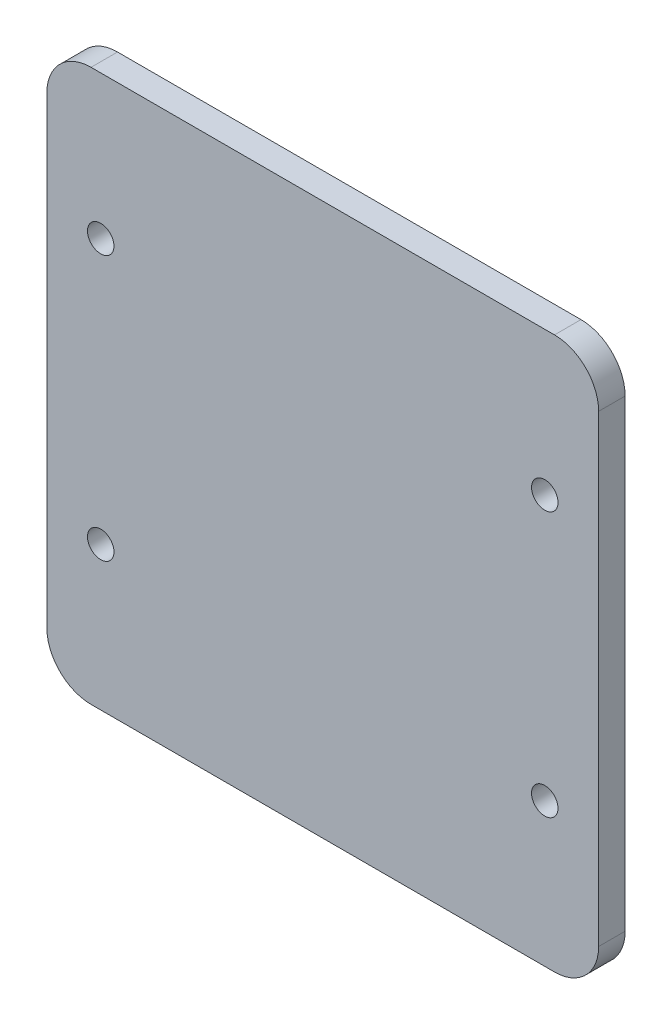
ISO-10303-21;
HEADER;
FILE_DESCRIPTION(('STEP AP214'),'2;1');
FILE_NAME('part.step','',(''),(''),'','','');
FILE_SCHEMA(('AUTOMOTIVE_DESIGN { 1 0 10303 214 1 1 1 1 }'));
ENDSEC;
DATA;
#1=APPLICATION_CONTEXT('core data for automotive mechanical design processes');
#2=APPLICATION_PROTOCOL_DEFINITION('international standard','automotive_design',2000,#1);
#3=PRODUCT_CONTEXT('',#1,'mechanical');
#4=PRODUCT('Part','Part','',(#3));
#5=PRODUCT_RELATED_PRODUCT_CATEGORY('part','',(#4));
#6=PRODUCT_DEFINITION_FORMATION('','',#4);
#7=PRODUCT_DEFINITION_CONTEXT('part definition',#1,'design');
#8=PRODUCT_DEFINITION('design','',#6,#7);
#9=PRODUCT_DEFINITION_SHAPE('','',#8);
#10=(LENGTH_UNIT() NAMED_UNIT(*) SI_UNIT(.MILLI.,.METRE.));
#11=(NAMED_UNIT(*) PLANE_ANGLE_UNIT() SI_UNIT($,.RADIAN.));
#12=(NAMED_UNIT(*) SI_UNIT($,.STERADIAN.) SOLID_ANGLE_UNIT());
#13=UNCERTAINTY_MEASURE_WITH_UNIT(LENGTH_MEASURE(1.E-05),#10,'distance_accuracy_value','');
#14=(GEOMETRIC_REPRESENTATION_CONTEXT(3) GLOBAL_UNCERTAINTY_ASSIGNED_CONTEXT((#13)) GLOBAL_UNIT_ASSIGNED_CONTEXT((#10,
#11,#12)) REPRESENTATION_CONTEXT('',''));
#15=CARTESIAN_POINT('',(0.,0.,0.));
#16=DIRECTION('',(0.,0.,1.));
#17=DIRECTION('',(1.,0.,0.));
#18=AXIS2_PLACEMENT_3D('',#15,#16,#17);
#19=CARTESIAN_POINT('',(-62.5,-62.5,6.));
#20=DIRECTION('',(1.,0.,0.));
#21=DIRECTION('',(0.,0.,-1.));
#22=AXIS2_PLACEMENT_3D('',#19,#20,#21);
#23=PLANE('',#22);
#24=DIRECTION('',(0.,-1.,0.));
#25=VECTOR('',#24,1.);
#26=CARTESIAN_POINT('',(-62.5,-62.5,6.));
#27=LINE('',#26,#25);
#28=CARTESIAN_POINT('',(-62.5,52.5,6.));
#29=VERTEX_POINT('',#28);
#30=CARTESIAN_POINT('',(-62.5,-52.5,6.));
#31=VERTEX_POINT('',#30);
#32=EDGE_CURVE('E128',#29,#31,#27,.T.);
#33=ORIENTED_EDGE('',*,*,#32,.F.);
#34=DIRECTION('',(0.,0.,-1.));
#35=VECTOR('',#34,1.);
#36=CARTESIAN_POINT('',(-62.5,52.5,6.));
#37=LINE('',#36,#35);
#38=CARTESIAN_POINT('',(-62.5,52.5,0.));
#39=VERTEX_POINT('',#38);
#40=EDGE_CURVE('E112',#29,#39,#37,.T.);
#41=ORIENTED_EDGE('',*,*,#40,.T.);
#42=DIRECTION('',(0.,-1.,0.));
#43=VECTOR('',#42,1.);
#44=CARTESIAN_POINT('',(-62.5,-62.5,0.));
#45=LINE('',#44,#43);
#46=CARTESIAN_POINT('',(-62.5,-52.5,0.));
#47=VERTEX_POINT('',#46);
#48=EDGE_CURVE('E125',#39,#47,#45,.T.);
#49=ORIENTED_EDGE('',*,*,#48,.T.);
#50=DIRECTION('',(0.,0.,-1.));
#51=VECTOR('',#50,1.);
#52=CARTESIAN_POINT('',(-62.5,-52.5,6.));
#53=LINE('',#52,#51);
#54=EDGE_CURVE('E131',#47,#31,#53,.F.);
#55=ORIENTED_EDGE('',*,*,#54,.T.);
#56=EDGE_LOOP('',(#33,#41,#49,#55));
#57=FACE_BOUND('',#56,.T.);
#58=ADVANCED_FACE('F39',(#57),#23,.F.);
#59=CARTESIAN_POINT('',(62.5,-62.5,6.));
#60=DIRECTION('',(0.,1.,0.));
#61=DIRECTION('',(-1.,0.,0.));
#62=AXIS2_PLACEMENT_3D('',#59,#60,#61);
#63=PLANE('',#62);
#64=DIRECTION('',(1.,0.,0.));
#65=VECTOR('',#64,1.);
#66=CARTESIAN_POINT('',(62.5,-62.5,0.));
#67=LINE('',#66,#65);
#68=CARTESIAN_POINT('',(-52.5,-62.5,0.));
#69=VERTEX_POINT('',#68);
#70=CARTESIAN_POINT('',(52.5,-62.5,0.));
#71=VERTEX_POINT('',#70);
#72=EDGE_CURVE('E136',#69,#71,#67,.T.);
#73=ORIENTED_EDGE('',*,*,#72,.T.);
#74=DIRECTION('',(0.,0.,-1.));
#75=VECTOR('',#74,1.);
#76=CARTESIAN_POINT('',(52.5,-62.5,6.));
#77=LINE('',#76,#75);
#78=CARTESIAN_POINT('',(52.5,-62.5,6.));
#79=VERTEX_POINT('',#78);
#80=EDGE_CURVE('E11',#71,#79,#77,.F.);
#81=ORIENTED_EDGE('',*,*,#80,.T.);
#82=DIRECTION('',(1.,0.,0.));
#83=VECTOR('',#82,1.);
#84=CARTESIAN_POINT('',(62.5,-62.5,6.));
#85=LINE('',#84,#83);
#86=CARTESIAN_POINT('',(-52.5,-62.5,6.));
#87=VERTEX_POINT('',#86);
#88=EDGE_CURVE('E254',#87,#79,#85,.T.);
#89=ORIENTED_EDGE('',*,*,#88,.F.);
#90=DIRECTION('',(0.,0.,-1.));
#91=VECTOR('',#90,1.);
#92=CARTESIAN_POINT('',(-52.5,-62.5,6.));
#93=LINE('',#92,#91);
#94=EDGE_CURVE('E49',#87,#69,#93,.T.);
#95=ORIENTED_EDGE('',*,*,#94,.T.);
#96=EDGE_LOOP('',(#73,#81,#89,#95));
#97=FACE_BOUND('',#96,.T.);
#98=ADVANCED_FACE('F220',(#97),#63,.F.);
#99=CARTESIAN_POINT('',(62.5,-62.5,6.));
#100=DIRECTION('',(-1.,0.,0.));
#101=DIRECTION('',(0.,0.,1.));
#102=AXIS2_PLACEMENT_3D('',#99,#100,#101);
#103=PLANE('',#102);
#104=DIRECTION('',(0.,1.,0.));
#105=VECTOR('',#104,1.);
#106=CARTESIAN_POINT('',(62.5,-62.5,0.));
#107=LINE('',#106,#105);
#108=CARTESIAN_POINT('',(62.5,-52.5,0.));
#109=VERTEX_POINT('',#108);
#110=CARTESIAN_POINT('',(62.5,52.5,0.));
#111=VERTEX_POINT('',#110);
#112=EDGE_CURVE('E141',#109,#111,#107,.T.);
#113=ORIENTED_EDGE('',*,*,#112,.T.);
#114=DIRECTION('',(0.,0.,-1.));
#115=VECTOR('',#114,1.);
#116=CARTESIAN_POINT('',(62.5,52.5,6.));
#117=LINE('',#116,#115);
#118=CARTESIAN_POINT('',(62.5,52.5,6.));
#119=VERTEX_POINT('',#118);
#120=EDGE_CURVE('E57',#111,#119,#117,.F.);
#121=ORIENTED_EDGE('',*,*,#120,.T.);
#122=DIRECTION('',(0.,1.,0.));
#123=VECTOR('',#122,1.);
#124=CARTESIAN_POINT('',(62.5,-62.5,6.));
#125=LINE('',#124,#123);
#126=CARTESIAN_POINT('',(62.5,-52.5,6.));
#127=VERTEX_POINT('',#126);
#128=EDGE_CURVE('E245',#127,#119,#125,.T.);
#129=ORIENTED_EDGE('',*,*,#128,.F.);
#130=DIRECTION('',(0.,0.,-1.));
#131=VECTOR('',#130,1.);
#132=CARTESIAN_POINT('',(62.5,-52.5,6.));
#133=LINE('',#132,#131);
#134=EDGE_CURVE('E179',#127,#109,#133,.T.);
#135=ORIENTED_EDGE('',*,*,#134,.T.);
#136=EDGE_LOOP('',(#113,#121,#129,#135));
#137=FACE_BOUND('',#136,.T.);
#138=ADVANCED_FACE('F225',(#137),#103,.F.);
#139=CARTESIAN_POINT('',(62.5,62.5,6.));
#140=DIRECTION('',(0.,-1.,0.));
#141=DIRECTION('',(1.,0.,0.));
#142=AXIS2_PLACEMENT_3D('',#139,#140,#141);
#143=PLANE('',#142);
#144=DIRECTION('',(-1.,0.,0.));
#145=VECTOR('',#144,1.);
#146=CARTESIAN_POINT('',(62.5,62.5,0.));
#147=LINE('',#146,#145);
#148=CARTESIAN_POINT('',(52.5,62.5,0.));
#149=VERTEX_POINT('',#148);
#150=CARTESIAN_POINT('',(-52.5,62.5,0.));
#151=VERTEX_POINT('',#150);
#152=EDGE_CURVE('E151',#149,#151,#147,.T.);
#153=ORIENTED_EDGE('',*,*,#152,.T.);
#154=DIRECTION('',(0.,0.,-1.));
#155=VECTOR('',#154,1.);
#156=CARTESIAN_POINT('',(-52.5,62.5,6.));
#157=LINE('',#156,#155);
#158=CARTESIAN_POINT('',(-52.5,62.5,6.));
#159=VERTEX_POINT('',#158);
#160=EDGE_CURVE('E113',#151,#159,#157,.F.);
#161=ORIENTED_EDGE('',*,*,#160,.T.);
#162=DIRECTION('',(-1.,0.,0.));
#163=VECTOR('',#162,1.);
#164=CARTESIAN_POINT('',(62.5,62.5,6.));
#165=LINE('',#164,#163);
#166=CARTESIAN_POINT('',(52.5,62.5,6.));
#167=VERTEX_POINT('',#166);
#168=EDGE_CURVE('E146',#167,#159,#165,.T.);
#169=ORIENTED_EDGE('',*,*,#168,.F.);
#170=DIRECTION('',(0.,0.,-1.));
#171=VECTOR('',#170,1.);
#172=CARTESIAN_POINT('',(52.5,62.5,6.));
#173=LINE('',#172,#171);
#174=EDGE_CURVE('E119',#167,#149,#173,.T.);
#175=ORIENTED_EDGE('',*,*,#174,.T.);
#176=EDGE_LOOP('',(#153,#161,#169,#175));
#177=FACE_BOUND('',#176,.T.);
#178=ADVANCED_FACE('F250',(#177),#143,.F.);
#179=CARTESIAN_POINT('',(0.,0.,6.));
#180=DIRECTION('',(0.,0.,1.));
#181=DIRECTION('',(1.,0.,0.));
#182=AXIS2_PLACEMENT_3D('',#179,#180,#181);
#183=PLANE('',#182);
#184=CARTESIAN_POINT('',(50.3,-30.,6.));
#185=DIRECTION('',(0.,0.,1.));
#186=DIRECTION('',(1.,0.,0.));
#187=AXIS2_PLACEMENT_3D('',#184,#185,#186);
#188=CIRCLE('',#187,3.);
#189=CARTESIAN_POINT('',(53.3,-30.,6.));
#190=VERTEX_POINT('',#189);
#191=EDGE_CURVE('E263',#190,#190,#188,.T.);
#192=ORIENTED_EDGE('',*,*,#191,.F.);
#193=EDGE_LOOP('',(#192));
#194=FACE_BOUND('',#193,.T.);
#195=CARTESIAN_POINT('',(-50.3,30.,6.));
#196=DIRECTION('',(0.,0.,1.));
#197=DIRECTION('',(1.,0.,0.));
#198=AXIS2_PLACEMENT_3D('',#195,#196,#197);
#199=CIRCLE('',#198,3.);
#200=CARTESIAN_POINT('',(-47.3,30.,6.));
#201=VERTEX_POINT('',#200);
#202=EDGE_CURVE('E264',#201,#201,#199,.T.);
#203=ORIENTED_EDGE('',*,*,#202,.F.);
#204=EDGE_LOOP('',(#203));
#205=FACE_BOUND('',#204,.T.);
#206=CARTESIAN_POINT('',(-50.3,-30.,6.));
#207=DIRECTION('',(0.,0.,1.));
#208=DIRECTION('',(1.,0.,0.));
#209=AXIS2_PLACEMENT_3D('',#206,#207,#208);
#210=CIRCLE('',#209,3.);
#211=CARTESIAN_POINT('',(-47.3,-30.,6.));
#212=VERTEX_POINT('',#211);
#213=EDGE_CURVE('E267',#212,#212,#210,.T.);
#214=ORIENTED_EDGE('',*,*,#213,.F.);
#215=EDGE_LOOP('',(#214));
#216=FACE_BOUND('',#215,.T.);
#217=CARTESIAN_POINT('',(50.3,30.,6.));
#218=DIRECTION('',(0.,0.,1.));
#219=DIRECTION('',(1.,0.,0.));
#220=AXIS2_PLACEMENT_3D('',#217,#218,#219);
#221=CIRCLE('',#220,3.);
#222=CARTESIAN_POINT('',(53.3,30.,6.));
#223=VERTEX_POINT('',#222);
#224=EDGE_CURVE('E193',#223,#223,#221,.T.);
#225=ORIENTED_EDGE('',*,*,#224,.F.);
#226=EDGE_LOOP('',(#225));
#227=FACE_BOUND('',#226,.T.);
#228=ORIENTED_EDGE('',*,*,#168,.T.);
#229=CARTESIAN_POINT('',(-52.5,52.5,6.));
#230=DIRECTION('',(0.,0.,1.));
#231=DIRECTION('',(1.,0.,0.));
#232=AXIS2_PLACEMENT_3D('',#229,#230,#231);
#233=CIRCLE('',#232,10.);
#234=EDGE_CURVE('E176',#159,#29,#233,.T.);
#235=ORIENTED_EDGE('',*,*,#234,.T.);
#236=ORIENTED_EDGE('',*,*,#32,.T.);
#237=CARTESIAN_POINT('',(-52.5,-52.5,6.));
#238=DIRECTION('',(0.,0.,1.));
#239=DIRECTION('',(1.,0.,0.));
#240=AXIS2_PLACEMENT_3D('',#237,#238,#239);
#241=CIRCLE('',#240,10.);
#242=EDGE_CURVE('E168',#31,#87,#241,.T.);
#243=ORIENTED_EDGE('',*,*,#242,.T.);
#244=ORIENTED_EDGE('',*,*,#88,.T.);
#245=CARTESIAN_POINT('',(52.5,-52.5,6.));
#246=DIRECTION('',(0.,0.,1.));
#247=DIRECTION('',(1.,0.,0.));
#248=AXIS2_PLACEMENT_3D('',#245,#246,#247);
#249=CIRCLE('',#248,10.);
#250=EDGE_CURVE('E64',#79,#127,#249,.T.);
#251=ORIENTED_EDGE('',*,*,#250,.T.);
#252=ORIENTED_EDGE('',*,*,#128,.T.);
#253=CARTESIAN_POINT('',(52.5,52.5,6.));
#254=DIRECTION('',(0.,0.,1.));
#255=DIRECTION('',(1.,0.,0.));
#256=AXIS2_PLACEMENT_3D('',#253,#254,#255);
#257=CIRCLE('',#256,10.);
#258=EDGE_CURVE('E173',#119,#167,#257,.T.);
#259=ORIENTED_EDGE('',*,*,#258,.T.);
#260=EDGE_LOOP('',(#228,#235,#236,#243,#244,#251,#252,#259));
#261=FACE_BOUND('',#260,.T.);
#262=ADVANCED_FACE('F276',(#194,#205,#216,#227,#261),#183,.T.);
#263=CARTESIAN_POINT('',(0.,0.,0.));
#264=DIRECTION('',(0.,0.,1.));
#265=DIRECTION('',(1.,0.,0.));
#266=AXIS2_PLACEMENT_3D('',#263,#264,#265);
#267=PLANE('',#266);
#268=CARTESIAN_POINT('',(50.3,-30.,0.));
#269=DIRECTION('',(0.,0.,1.));
#270=DIRECTION('',(1.,0.,0.));
#271=AXIS2_PLACEMENT_3D('',#268,#269,#270);
#272=CIRCLE('',#271,3.);
#273=CARTESIAN_POINT('',(53.3,-30.,0.));
#274=VERTEX_POINT('',#273);
#275=EDGE_CURVE('E43',#274,#274,#272,.T.);
#276=ORIENTED_EDGE('',*,*,#275,.T.);
#277=EDGE_LOOP('',(#276));
#278=FACE_BOUND('',#277,.T.);
#279=CARTESIAN_POINT('',(-50.3,30.,0.));
#280=DIRECTION('',(0.,0.,1.));
#281=DIRECTION('',(1.,0.,0.));
#282=AXIS2_PLACEMENT_3D('',#279,#280,#281);
#283=CIRCLE('',#282,3.);
#284=CARTESIAN_POINT('',(-47.3,30.,0.));
#285=VERTEX_POINT('',#284);
#286=EDGE_CURVE('E144',#285,#285,#283,.T.);
#287=ORIENTED_EDGE('',*,*,#286,.T.);
#288=EDGE_LOOP('',(#287));
#289=FACE_BOUND('',#288,.T.);
#290=CARTESIAN_POINT('',(-50.3,-30.,0.));
#291=DIRECTION('',(0.,0.,1.));
#292=DIRECTION('',(1.,0.,0.));
#293=AXIS2_PLACEMENT_3D('',#290,#291,#292);
#294=CIRCLE('',#293,3.);
#295=CARTESIAN_POINT('',(-47.3,-30.,0.));
#296=VERTEX_POINT('',#295);
#297=EDGE_CURVE('E192',#296,#296,#294,.T.);
#298=ORIENTED_EDGE('',*,*,#297,.T.);
#299=EDGE_LOOP('',(#298));
#300=FACE_BOUND('',#299,.T.);
#301=CARTESIAN_POINT('',(50.3,30.,0.));
#302=DIRECTION('',(0.,0.,1.));
#303=DIRECTION('',(1.,0.,0.));
#304=AXIS2_PLACEMENT_3D('',#301,#302,#303);
#305=CIRCLE('',#304,3.);
#306=CARTESIAN_POINT('',(53.3,30.,0.));
#307=VERTEX_POINT('',#306);
#308=EDGE_CURVE('E188',#307,#307,#305,.T.);
#309=ORIENTED_EDGE('',*,*,#308,.T.);
#310=EDGE_LOOP('',(#309));
#311=FACE_BOUND('',#310,.T.);
#312=ORIENTED_EDGE('',*,*,#48,.F.);
#313=CARTESIAN_POINT('',(-52.5,52.5,0.));
#314=DIRECTION('',(0.,0.,1.));
#315=DIRECTION('',(1.,0.,0.));
#316=AXIS2_PLACEMENT_3D('',#313,#314,#315);
#317=CIRCLE('',#316,10.);
#318=EDGE_CURVE('E108',#39,#151,#317,.F.);
#319=ORIENTED_EDGE('',*,*,#318,.T.);
#320=ORIENTED_EDGE('',*,*,#152,.F.);
#321=CARTESIAN_POINT('',(52.5,52.5,0.));
#322=DIRECTION('',(0.,0.,1.));
#323=DIRECTION('',(1.,0.,0.));
#324=AXIS2_PLACEMENT_3D('',#321,#322,#323);
#325=CIRCLE('',#324,10.);
#326=EDGE_CURVE('E120',#149,#111,#325,.F.);
#327=ORIENTED_EDGE('',*,*,#326,.T.);
#328=ORIENTED_EDGE('',*,*,#112,.F.);
#329=CARTESIAN_POINT('',(52.5,-52.5,0.));
#330=DIRECTION('',(0.,0.,1.));
#331=DIRECTION('',(1.,0.,0.));
#332=AXIS2_PLACEMENT_3D('',#329,#330,#331);
#333=CIRCLE('',#332,10.);
#334=EDGE_CURVE('E158',#109,#71,#333,.F.);
#335=ORIENTED_EDGE('',*,*,#334,.T.);
#336=ORIENTED_EDGE('',*,*,#72,.F.);
#337=CARTESIAN_POINT('',(-52.5,-52.5,0.));
#338=DIRECTION('',(0.,0.,1.));
#339=DIRECTION('',(1.,0.,0.));
#340=AXIS2_PLACEMENT_3D('',#337,#338,#339);
#341=CIRCLE('',#340,10.);
#342=EDGE_CURVE('E130',#69,#47,#341,.F.);
#343=ORIENTED_EDGE('',*,*,#342,.T.);
#344=EDGE_LOOP('',(#312,#319,#320,#327,#328,#335,#336,#343));
#345=FACE_BOUND('',#344,.T.);
#346=ADVANCED_FACE('F133',(#278,#289,#300,#311,#345),#267,.F.);
#347=CARTESIAN_POINT('',(-52.5,52.5,6.));
#348=DIRECTION('',(0.,0.,-1.));
#349=DIRECTION('',(-1.,0.,0.));
#350=AXIS2_PLACEMENT_3D('',#347,#348,#349);
#351=CYLINDRICAL_SURFACE('',#350,10.);
#352=ORIENTED_EDGE('',*,*,#234,.F.);
#353=ORIENTED_EDGE('',*,*,#160,.F.);
#354=ORIENTED_EDGE('',*,*,#318,.F.);
#355=ORIENTED_EDGE('',*,*,#40,.F.);
#356=EDGE_LOOP('',(#352,#353,#354,#355));
#357=FACE_BOUND('',#356,.T.);
#358=ADVANCED_FACE('F111',(#357),#351,.T.);
#359=CARTESIAN_POINT('',(52.5,52.5,6.));
#360=DIRECTION('',(0.,0.,-1.));
#361=DIRECTION('',(-1.,0.,0.));
#362=AXIS2_PLACEMENT_3D('',#359,#360,#361);
#363=CYLINDRICAL_SURFACE('',#362,10.);
#364=ORIENTED_EDGE('',*,*,#258,.F.);
#365=ORIENTED_EDGE('',*,*,#120,.F.);
#366=ORIENTED_EDGE('',*,*,#326,.F.);
#367=ORIENTED_EDGE('',*,*,#174,.F.);
#368=EDGE_LOOP('',(#364,#365,#366,#367));
#369=FACE_BOUND('',#368,.T.);
#370=ADVANCED_FACE('F232',(#369),#363,.T.);
#371=CARTESIAN_POINT('',(52.5,-52.5,6.));
#372=DIRECTION('',(0.,0.,-1.));
#373=DIRECTION('',(-1.,0.,0.));
#374=AXIS2_PLACEMENT_3D('',#371,#372,#373);
#375=CYLINDRICAL_SURFACE('',#374,10.);
#376=ORIENTED_EDGE('',*,*,#250,.F.);
#377=ORIENTED_EDGE('',*,*,#80,.F.);
#378=ORIENTED_EDGE('',*,*,#334,.F.);
#379=ORIENTED_EDGE('',*,*,#134,.F.);
#380=EDGE_LOOP('',(#376,#377,#378,#379));
#381=FACE_BOUND('',#380,.T.);
#382=ADVANCED_FACE('F234',(#381),#375,.T.);
#383=CARTESIAN_POINT('',(-52.5,-52.5,6.));
#384=DIRECTION('',(0.,0.,-1.));
#385=DIRECTION('',(-1.,0.,0.));
#386=AXIS2_PLACEMENT_3D('',#383,#384,#385);
#387=CYLINDRICAL_SURFACE('',#386,10.);
#388=ORIENTED_EDGE('',*,*,#242,.F.);
#389=ORIENTED_EDGE('',*,*,#54,.F.);
#390=ORIENTED_EDGE('',*,*,#342,.F.);
#391=ORIENTED_EDGE('',*,*,#94,.F.);
#392=EDGE_LOOP('',(#388,#389,#390,#391));
#393=FACE_BOUND('',#392,.T.);
#394=ADVANCED_FACE('F41',(#393),#387,.T.);
#395=CARTESIAN_POINT('',(50.3,30.,-4.));
#396=DIRECTION('',(0.,0.,1.));
#397=DIRECTION('',(1.,0.,0.));
#398=AXIS2_PLACEMENT_3D('',#395,#396,#397);
#399=CYLINDRICAL_SURFACE('',#398,3.);
#400=ORIENTED_EDGE('',*,*,#224,.T.);
#401=EDGE_LOOP('',(#400));
#402=FACE_BOUND('',#401,.T.);
#403=ORIENTED_EDGE('',*,*,#308,.F.);
#404=EDGE_LOOP('',(#403));
#405=FACE_BOUND('',#404,.T.);
#406=ADVANCED_FACE('F214',(#402,#405),#399,.F.);
#407=CARTESIAN_POINT('',(-50.3,-30.,-4.));
#408=DIRECTION('',(0.,0.,1.));
#409=DIRECTION('',(1.,0.,0.));
#410=AXIS2_PLACEMENT_3D('',#407,#408,#409);
#411=CYLINDRICAL_SURFACE('',#410,3.);
#412=ORIENTED_EDGE('',*,*,#213,.T.);
#413=EDGE_LOOP('',(#412));
#414=FACE_BOUND('',#413,.T.);
#415=ORIENTED_EDGE('',*,*,#297,.F.);
#416=EDGE_LOOP('',(#415));
#417=FACE_BOUND('',#416,.T.);
#418=ADVANCED_FACE('F205',(#414,#417),#411,.F.);
#419=CARTESIAN_POINT('',(-50.3,30.,-4.));
#420=DIRECTION('',(0.,0.,1.));
#421=DIRECTION('',(1.,0.,0.));
#422=AXIS2_PLACEMENT_3D('',#419,#420,#421);
#423=CYLINDRICAL_SURFACE('',#422,3.);
#424=ORIENTED_EDGE('',*,*,#202,.T.);
#425=EDGE_LOOP('',(#424));
#426=FACE_BOUND('',#425,.T.);
#427=ORIENTED_EDGE('',*,*,#286,.F.);
#428=EDGE_LOOP('',(#427));
#429=FACE_BOUND('',#428,.T.);
#430=ADVANCED_FACE('F202',(#426,#429),#423,.F.);
#431=CARTESIAN_POINT('',(50.3,-30.,-4.));
#432=DIRECTION('',(0.,0.,1.));
#433=DIRECTION('',(1.,0.,0.));
#434=AXIS2_PLACEMENT_3D('',#431,#432,#433);
#435=CYLINDRICAL_SURFACE('',#434,3.);
#436=ORIENTED_EDGE('',*,*,#191,.T.);
#437=EDGE_LOOP('',(#436));
#438=FACE_BOUND('',#437,.T.);
#439=ORIENTED_EDGE('',*,*,#275,.F.);
#440=EDGE_LOOP('',(#439));
#441=FACE_BOUND('',#440,.T.);
#442=ADVANCED_FACE('F204',(#438,#441),#435,.F.);
#443=CLOSED_SHELL('',(#58,#98,#138,#178,#262,#346,#358,#370,#382,#394,#406,#418,#430,#442));
#444=MANIFOLD_SOLID_BREP('B2',#443);
#445=ADVANCED_BREP_SHAPE_REPRESENTATION('',(#18,#444),#14);
#446=SHAPE_DEFINITION_REPRESENTATION(#9,#445);
ENDSEC;
END-ISO-10303-21;
